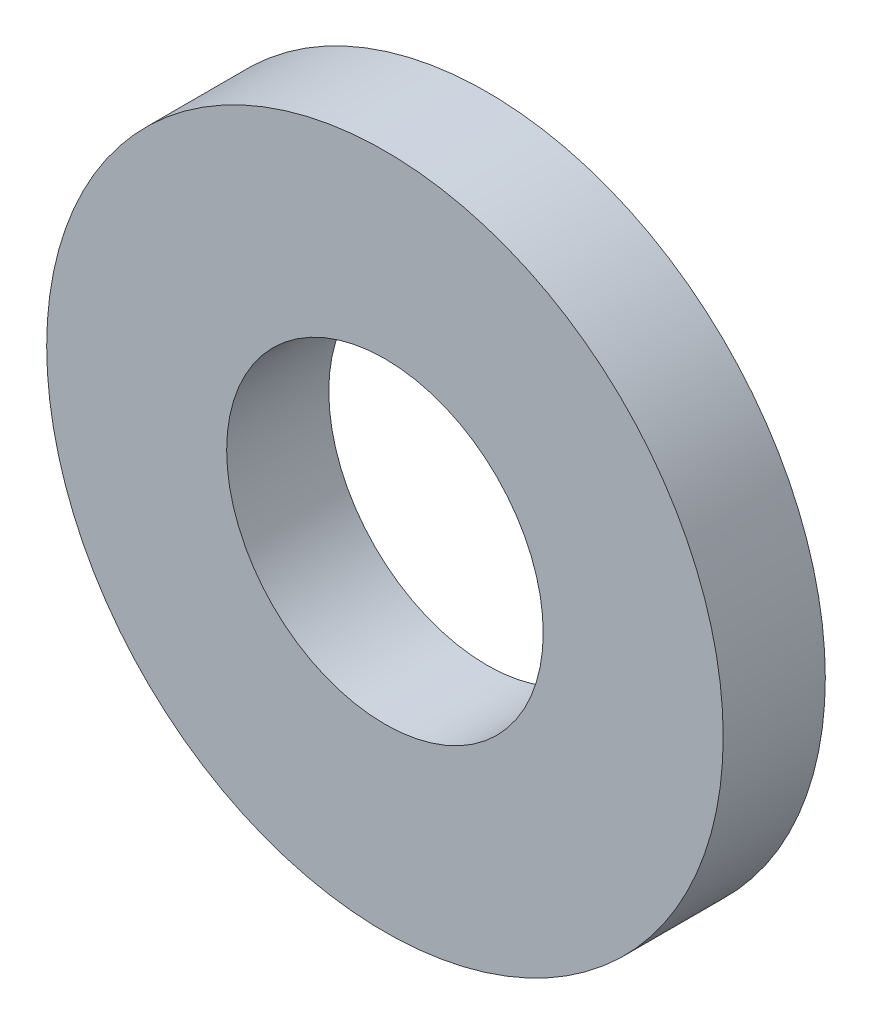
ISO-10303-21;
HEADER;
FILE_DESCRIPTION(('STEP AP214'),'2;1');
FILE_NAME('part.step','',(''),(''),'','','');
FILE_SCHEMA(('AUTOMOTIVE_DESIGN { 1 0 10303 214 1 1 1 1 }'));
ENDSEC;
DATA;
#1=APPLICATION_CONTEXT('core data for automotive mechanical design processes');
#2=APPLICATION_PROTOCOL_DEFINITION('international standard','automotive_design',2000,#1);
#3=PRODUCT_CONTEXT('',#1,'mechanical');
#4=PRODUCT('Part','Part','',(#3));
#5=PRODUCT_RELATED_PRODUCT_CATEGORY('part','',(#4));
#6=PRODUCT_DEFINITION_FORMATION('','',#4);
#7=PRODUCT_DEFINITION_CONTEXT('part definition',#1,'design');
#8=PRODUCT_DEFINITION('design','',#6,#7);
#9=PRODUCT_DEFINITION_SHAPE('','',#8);
#10=(LENGTH_UNIT() NAMED_UNIT(*) SI_UNIT(.MILLI.,.METRE.));
#11=(NAMED_UNIT(*) PLANE_ANGLE_UNIT() SI_UNIT($,.RADIAN.));
#12=(NAMED_UNIT(*) SI_UNIT($,.STERADIAN.) SOLID_ANGLE_UNIT());
#13=UNCERTAINTY_MEASURE_WITH_UNIT(LENGTH_MEASURE(1.E-05),#10,'distance_accuracy_value','');
#14=(GEOMETRIC_REPRESENTATION_CONTEXT(3) GLOBAL_UNCERTAINTY_ASSIGNED_CONTEXT((#13)) GLOBAL_UNIT_ASSIGNED_CONTEXT((#10,
#11,#12)) REPRESENTATION_CONTEXT('',''));
#15=CARTESIAN_POINT('',(0.,0.,0.));
#16=DIRECTION('',(0.,0.,1.));
#17=DIRECTION('',(1.,0.,0.));
#18=AXIS2_PLACEMENT_3D('',#15,#16,#17);
#19=CARTESIAN_POINT('',(0.,0.,20.));
#20=DIRECTION('',(0.,0.,1.));
#21=DIRECTION('',(1.,0.,0.));
#22=AXIS2_PLACEMENT_3D('',#19,#20,#21);
#23=PLANE('',#22);
#24=CARTESIAN_POINT('',(0.,0.,20.));
#25=DIRECTION('',(0.,0.,1.));
#26=DIRECTION('',(1.,0.,0.));
#27=AXIS2_PLACEMENT_3D('',#24,#25,#26);
#28=CIRCLE('',#27,31.);
#29=CARTESIAN_POINT('',(31.,0.,20.));
#30=VERTEX_POINT('',#29);
#31=EDGE_CURVE('E70',#30,#30,#28,.T.);
#32=ORIENTED_EDGE('',*,*,#31,.F.);
#33=EDGE_LOOP('',(#32));
#34=FACE_BOUND('',#33,.T.);
#35=CARTESIAN_POINT('',(0.,0.,20.));
#36=DIRECTION('',(0.,0.,1.));
#37=DIRECTION('',(1.,0.,0.));
#38=AXIS2_PLACEMENT_3D('',#35,#36,#37);
#39=CIRCLE('',#38,66.25);
#40=CARTESIAN_POINT('',(66.25,0.,20.));
#41=VERTEX_POINT('',#40);
#42=EDGE_CURVE('E13',#41,#41,#39,.T.);
#43=ORIENTED_EDGE('',*,*,#42,.T.);
#44=EDGE_LOOP('',(#43));
#45=FACE_BOUND('',#44,.T.);
#46=ADVANCED_FACE('F55',(#34,#45),#23,.T.);
#47=CARTESIAN_POINT('',(0.,0.,0.));
#48=DIRECTION('',(0.,0.,1.));
#49=DIRECTION('',(1.,0.,0.));
#50=AXIS2_PLACEMENT_3D('',#47,#48,#49);
#51=PLANE('',#50);
#52=CARTESIAN_POINT('',(0.,0.,0.));
#53=DIRECTION('',(0.,0.,1.));
#54=DIRECTION('',(1.,0.,0.));
#55=AXIS2_PLACEMENT_3D('',#52,#53,#54);
#56=CIRCLE('',#55,31.);
#57=CARTESIAN_POINT('',(31.,0.,0.));
#58=VERTEX_POINT('',#57);
#59=EDGE_CURVE('E68',#58,#58,#56,.T.);
#60=ORIENTED_EDGE('',*,*,#59,.T.);
#61=EDGE_LOOP('',(#60));
#62=FACE_BOUND('',#61,.T.);
#63=CARTESIAN_POINT('',(0.,0.,0.));
#64=DIRECTION('',(0.,0.,1.));
#65=DIRECTION('',(1.,0.,0.));
#66=AXIS2_PLACEMENT_3D('',#63,#64,#65);
#67=CIRCLE('',#66,66.25);
#68=CARTESIAN_POINT('',(66.25,0.,0.));
#69=VERTEX_POINT('',#68);
#70=EDGE_CURVE('E59',#69,#69,#67,.T.);
#71=ORIENTED_EDGE('',*,*,#70,.F.);
#72=EDGE_LOOP('',(#71));
#73=FACE_BOUND('',#72,.T.);
#74=ADVANCED_FACE('F78',(#62,#73),#51,.F.);
#75=CARTESIAN_POINT('',(0.,0.,20.));
#76=DIRECTION('',(0.,0.,-1.));
#77=DIRECTION('',(-1.,0.,0.));
#78=AXIS2_PLACEMENT_3D('',#75,#76,#77);
#79=CYLINDRICAL_SURFACE('',#78,66.25);
#80=ORIENTED_EDGE('',*,*,#42,.F.);
#81=EDGE_LOOP('',(#80));
#82=FACE_BOUND('',#81,.T.);
#83=ORIENTED_EDGE('',*,*,#70,.T.);
#84=EDGE_LOOP('',(#83));
#85=FACE_BOUND('',#84,.T.);
#86=ADVANCED_FACE('F57',(#82,#85),#79,.T.);
#87=CARTESIAN_POINT('',(0.,0.,0.));
#88=DIRECTION('',(0.,0.,1.));
#89=DIRECTION('',(1.,0.,0.));
#90=AXIS2_PLACEMENT_3D('',#87,#88,#89);
#91=CYLINDRICAL_SURFACE('',#90,31.);
#92=ORIENTED_EDGE('',*,*,#59,.F.);
#93=EDGE_LOOP('',(#92));
#94=FACE_BOUND('',#93,.T.);
#95=ORIENTED_EDGE('',*,*,#31,.T.);
#96=EDGE_LOOP('',(#95));
#97=FACE_BOUND('',#96,.T.);
#98=ADVANCED_FACE('F81',(#94,#97),#91,.F.);
#99=CLOSED_SHELL('',(#46,#74,#86,#98));
#100=MANIFOLD_SOLID_BREP('B2',#99);
#101=ADVANCED_BREP_SHAPE_REPRESENTATION('',(#18,#100),#14);
#102=SHAPE_DEFINITION_REPRESENTATION(#9,#101);
ENDSEC;
END-ISO-10303-21;
